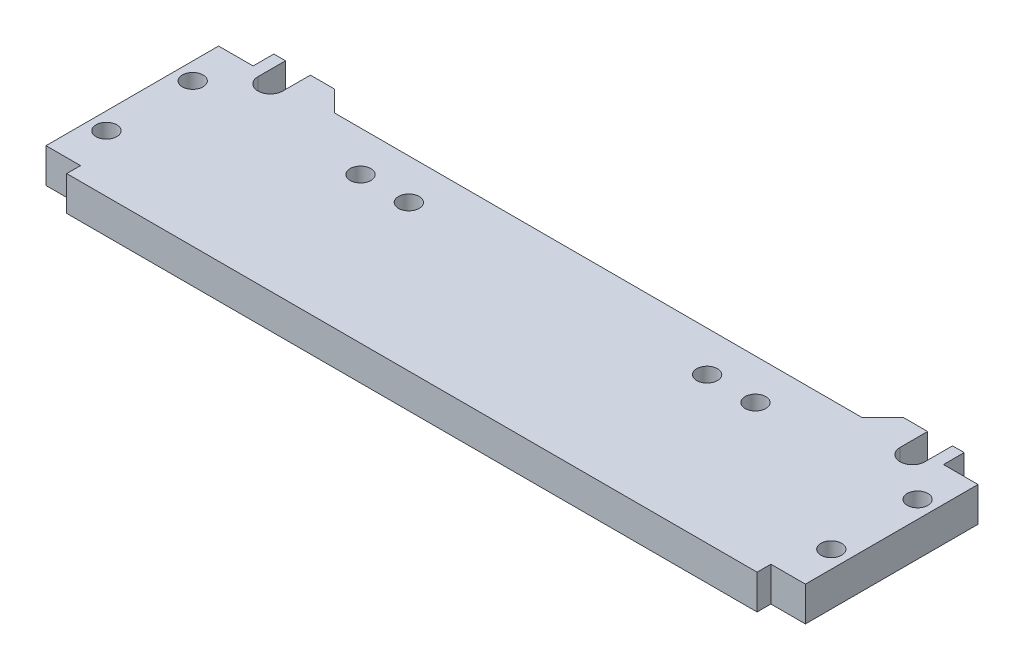
ISO-10303-21;
HEADER;
FILE_DESCRIPTION(('STEP AP214'),'2;1');
FILE_NAME('part.step','',(''),(''),'','','');
FILE_SCHEMA(('AUTOMOTIVE_DESIGN { 1 0 10303 214 1 1 1 1 }'));
ENDSEC;
DATA;
#1=APPLICATION_CONTEXT('core data for automotive mechanical design processes');
#2=APPLICATION_PROTOCOL_DEFINITION('international standard','automotive_design',2000,#1);
#3=PRODUCT_CONTEXT('',#1,'mechanical');
#4=PRODUCT('Part','Part','',(#3));
#5=PRODUCT_RELATED_PRODUCT_CATEGORY('part','',(#4));
#6=PRODUCT_DEFINITION_FORMATION('','',#4);
#7=PRODUCT_DEFINITION_CONTEXT('part definition',#1,'design');
#8=PRODUCT_DEFINITION('design','',#6,#7);
#9=PRODUCT_DEFINITION_SHAPE('','',#8);
#10=(LENGTH_UNIT() NAMED_UNIT(*) SI_UNIT(.MILLI.,.METRE.));
#11=(NAMED_UNIT(*) PLANE_ANGLE_UNIT() SI_UNIT($,.RADIAN.));
#12=(NAMED_UNIT(*) SI_UNIT($,.STERADIAN.) SOLID_ANGLE_UNIT());
#13=UNCERTAINTY_MEASURE_WITH_UNIT(LENGTH_MEASURE(1.E-05),#10,'distance_accuracy_value','');
#14=(GEOMETRIC_REPRESENTATION_CONTEXT(3) GLOBAL_UNCERTAINTY_ASSIGNED_CONTEXT((#13)) GLOBAL_UNIT_ASSIGNED_CONTEXT((#10,
#11,#12)) REPRESENTATION_CONTEXT('',''));
#15=CARTESIAN_POINT('',(0.,0.,0.));
#16=DIRECTION('',(0.,0.,1.));
#17=DIRECTION('',(1.,0.,0.));
#18=AXIS2_PLACEMENT_3D('',#15,#16,#17);
#19=CARTESIAN_POINT('',(110.,0.601965351764868,17.1368896841459));
#20=DIRECTION('',(0.,1.,0.));
#21=DIRECTION('',(0.,0.,1.));
#22=AXIS2_PLACEMENT_3D('',#19,#20,#21);
#23=PLANE('',#22);
#24=CARTESIAN_POINT('',(2.5,0.601965351764866,8.88688968414594));
#25=DIRECTION('',(0.,-1.,0.));
#26=DIRECTION('',(0.,0.,-1.));
#27=AXIS2_PLACEMENT_3D('',#24,#25,#26);
#28=CIRCLE('',#27,1.49999999999999);
#29=CARTESIAN_POINT('',(2.5,0.601965351764866,7.38688968414595));
#30=VERTEX_POINT('',#29);
#31=EDGE_CURVE('E799',#30,#30,#28,.T.);
#32=ORIENTED_EDGE('',*,*,#31,.F.);
#33=EDGE_LOOP('',(#32));
#34=FACE_BOUND('',#33,.T.);
#35=CARTESIAN_POINT('',(107.5,0.601965351764866,-3.61311031585405));
#36=DIRECTION('',(0.,-1.,0.));
#37=DIRECTION('',(0.,0.,-1.));
#38=AXIS2_PLACEMENT_3D('',#35,#36,#37);
#39=CIRCLE('',#38,1.49999999999999);
#40=CARTESIAN_POINT('',(107.5,0.601965351764866,-5.11311031585404));
#41=VERTEX_POINT('',#40);
#42=EDGE_CURVE('E490',#41,#41,#39,.T.);
#43=ORIENTED_EDGE('',*,*,#42,.F.);
#44=EDGE_LOOP('',(#43));
#45=FACE_BOUND('',#44,.T.);
#46=CARTESIAN_POINT('',(107.5,0.601965351764866,8.88688968414594));
#47=DIRECTION('',(0.,-1.,0.));
#48=DIRECTION('',(0.,0.,-1.));
#49=AXIS2_PLACEMENT_3D('',#46,#47,#48);
#50=CIRCLE('',#49,1.49999999999999);
#51=CARTESIAN_POINT('',(107.5,0.601965351764866,7.38688968414596));
#52=VERTEX_POINT('',#51);
#53=EDGE_CURVE('E481',#52,#52,#50,.T.);
#54=ORIENTED_EDGE('',*,*,#53,.F.);
#55=EDGE_LOOP('',(#54));
#56=FACE_BOUND('',#55,.T.);
#57=CARTESIAN_POINT('',(33.3970290493622,0.601965351764868,-4.02233273689054));
#58=DIRECTION('',(0.,1.,0.));
#59=DIRECTION('',(0.,0.,1.));
#60=AXIS2_PLACEMENT_3D('',#57,#58,#59);
#61=CIRCLE('',#60,1.5);
#62=CARTESIAN_POINT('',(33.3970290493622,0.601965351764868,-2.52233273689054));
#63=VERTEX_POINT('',#62);
#64=EDGE_CURVE('E389',#63,#63,#61,.T.);
#65=ORIENTED_EDGE('',*,*,#64,.T.);
#66=EDGE_LOOP('',(#65));
#67=FACE_BOUND('',#66,.T.);
#68=CARTESIAN_POINT('',(26.3970290493622,0.601965351764868,-4.02233273689054));
#69=DIRECTION('',(0.,1.,0.));
#70=DIRECTION('',(0.,0.,1.));
#71=AXIS2_PLACEMENT_3D('',#68,#69,#70);
#72=CIRCLE('',#71,1.5);
#73=CARTESIAN_POINT('',(26.3970290493622,0.601965351764868,-2.52233273689054));
#74=VERTEX_POINT('',#73);
#75=EDGE_CURVE('E383',#74,#74,#72,.T.);
#76=ORIENTED_EDGE('',*,*,#75,.T.);
#77=EDGE_LOOP('',(#76));
#78=FACE_BOUND('',#77,.T.);
#79=CARTESIAN_POINT('',(76.6029709506378,0.601965351764868,-4.02233273689054));
#80=DIRECTION('',(0.,1.,0.));
#81=DIRECTION('',(0.,0.,1.));
#82=AXIS2_PLACEMENT_3D('',#79,#80,#81);
#83=CIRCLE('',#82,1.5);
#84=CARTESIAN_POINT('',(76.6029709506378,0.601965351764868,-2.52233273689054));
#85=VERTEX_POINT('',#84);
#86=EDGE_CURVE('E377',#85,#85,#83,.T.);
#87=ORIENTED_EDGE('',*,*,#86,.T.);
#88=EDGE_LOOP('',(#87));
#89=FACE_BOUND('',#88,.T.);
#90=CARTESIAN_POINT('',(83.6029709506378,0.601965351764868,-4.02233273689054));
#91=DIRECTION('',(0.,1.,0.));
#92=DIRECTION('',(0.,0.,1.));
#93=AXIS2_PLACEMENT_3D('',#90,#91,#92);
#94=CIRCLE('',#93,1.5);
#95=CARTESIAN_POINT('',(83.6029709506378,0.601965351764868,-2.52233273689054));
#96=VERTEX_POINT('',#95);
#97=EDGE_CURVE('E371',#96,#96,#94,.T.);
#98=ORIENTED_EDGE('',*,*,#97,.T.);
#99=EDGE_LOOP('',(#98));
#100=FACE_BOUND('',#99,.T.);
#101=DIRECTION('',(1.,0.,0.));
#102=VECTOR('',#101,1.);
#103=CARTESIAN_POINT('',(10.3259524383656,0.601965351764868,-12.8631103158541));
#104=LINE('',#103,#102);
#105=CARTESIAN_POINT('',(10.294934667809,0.601965351764868,-12.8631103158541));
#106=VERTEX_POINT('',#105);
#107=CARTESIAN_POINT('',(13.7997678373939,0.601965351764868,-12.8631103158541));
#108=VERTEX_POINT('',#107);
#109=EDGE_CURVE('E209',#106,#108,#104,.T.);
#110=ORIENTED_EDGE('',*,*,#109,.T.);
#111=DIRECTION('',(-0.707106781186549,0.,-0.707106781186546));
#112=VECTOR('',#111,1.);
#113=CARTESIAN_POINT('',(16.7997678373939,0.601965351764868,-9.86311031585407));
#114=LINE('',#113,#112);
#115=CARTESIAN_POINT('',(16.7997678373939,0.601965351764868,-9.86311031585406));
#116=VERTEX_POINT('',#115);
#117=EDGE_CURVE('E11',#108,#116,#114,.F.);
#118=ORIENTED_EDGE('',*,*,#117,.T.);
#119=DIRECTION('',(-1.,0.,0.));
#120=VECTOR('',#119,1.);
#121=CARTESIAN_POINT('',(110.,0.601965351764868,-9.86311031585406));
#122=LINE('',#121,#120);
#123=CARTESIAN_POINT('',(93.2002321626061,0.601965351764868,-9.86311031585406));
#124=VERTEX_POINT('',#123);
#125=EDGE_CURVE('E324',#124,#116,#122,.T.);
#126=ORIENTED_EDGE('',*,*,#125,.F.);
#127=DIRECTION('',(-0.707106781186549,0.,0.707106781186546));
#128=VECTOR('',#127,1.);
#129=CARTESIAN_POINT('',(96.2002321626061,0.601965351764868,-12.8631103158541));
#130=LINE('',#129,#128);
#131=CARTESIAN_POINT('',(96.2002321626061,0.601965351764868,-12.8631103158541));
#132=VERTEX_POINT('',#131);
#133=EDGE_CURVE('E287',#124,#132,#130,.F.);
#134=ORIENTED_EDGE('',*,*,#133,.T.);
#135=DIRECTION('',(-1.,0.,0.));
#136=VECTOR('',#135,1.);
#137=CARTESIAN_POINT('',(105.,0.601965351764868,-12.8631103158541));
#138=LINE('',#137,#136);
#139=CARTESIAN_POINT('',(99.705065332191,0.601965351764868,-12.8631103158541));
#140=VERTEX_POINT('',#139);
#141=EDGE_CURVE('E259',#140,#132,#138,.T.);
#142=ORIENTED_EDGE('',*,*,#141,.F.);
#143=DIRECTION('',(0.,0.,1.));
#144=VECTOR('',#143,1.);
#145=CARTESIAN_POINT('',(99.705065332191,0.601965351764868,17.1368896841459));
#146=LINE('',#145,#144);
#147=CARTESIAN_POINT('',(99.705065332191,0.601965351764868,-8.86311031585405));
#148=VERTEX_POINT('',#147);
#149=EDGE_CURVE('E246',#140,#148,#146,.T.);
#150=ORIENTED_EDGE('',*,*,#149,.T.);
#151=CARTESIAN_POINT('',(101.505065332191,0.601965351764868,-8.86311031585406));
#152=DIRECTION('',(0.,1.,0.));
#153=DIRECTION('',(0.,0.,1.));
#154=AXIS2_PLACEMENT_3D('',#151,#152,#153);
#155=CIRCLE('',#154,1.8);
#156=CARTESIAN_POINT('',(103.305065332191,0.601965351764868,-8.86311031585405));
#157=VERTEX_POINT('',#156);
#158=EDGE_CURVE('E252',#157,#148,#155,.F.);
#159=ORIENTED_EDGE('',*,*,#158,.F.);
#160=DIRECTION('',(0.,0.,-1.));
#161=VECTOR('',#160,1.);
#162=CARTESIAN_POINT('',(103.305065332191,0.601965351764868,17.1368896841459));
#163=LINE('',#162,#161);
#164=CARTESIAN_POINT('',(103.305065332191,0.601965351764868,-12.8631103158541));
#165=VERTEX_POINT('',#164);
#166=EDGE_CURVE('E249',#157,#165,#163,.T.);
#167=ORIENTED_EDGE('',*,*,#166,.T.);
#168=CARTESIAN_POINT('',(105.,0.601965351764868,-12.8631103158541));
#169=VERTEX_POINT('',#168);
#170=EDGE_CURVE('E255',#169,#165,#138,.T.);
#171=ORIENTED_EDGE('',*,*,#170,.F.);
#172=DIRECTION('',(0.,0.,-1.));
#173=VECTOR('',#172,1.);
#174=CARTESIAN_POINT('',(105.,0.601965351764868,-9.86311031585406));
#175=LINE('',#174,#173);
#176=CARTESIAN_POINT('',(105.,0.601965351764868,-9.86311031585406));
#177=VERTEX_POINT('',#176);
#178=EDGE_CURVE('E263',#177,#169,#175,.T.);
#179=ORIENTED_EDGE('',*,*,#178,.F.);
#180=CARTESIAN_POINT('',(110.,0.601965351764868,-9.86311031585406));
#181=VERTEX_POINT('',#180);
#182=EDGE_CURVE('E317',#181,#177,#122,.T.);
#183=ORIENTED_EDGE('',*,*,#182,.F.);
#184=DIRECTION('',(0.,0.,-1.));
#185=VECTOR('',#184,1.);
#186=CARTESIAN_POINT('',(110.,0.601965351764868,17.1368896841459));
#187=LINE('',#186,#185);
#188=CARTESIAN_POINT('',(110.,0.601965351764868,15.1368896841459));
#189=VERTEX_POINT('',#188);
#190=EDGE_CURVE('E393',#189,#181,#187,.T.);
#191=ORIENTED_EDGE('',*,*,#190,.F.);
#192=DIRECTION('',(-1.,0.,0.));
#193=VECTOR('',#192,1.);
#194=CARTESIAN_POINT('',(110.,0.601965351764868,15.1368896841459));
#195=LINE('',#194,#193);
#196=CARTESIAN_POINT('',(105.,0.601965351764868,15.1368896841459));
#197=VERTEX_POINT('',#196);
#198=EDGE_CURVE('E347',#189,#197,#195,.T.);
#199=ORIENTED_EDGE('',*,*,#198,.T.);
#200=DIRECTION('',(0.,0.,-1.));
#201=VECTOR('',#200,1.);
#202=CARTESIAN_POINT('',(105.,0.601965351764868,17.1368896841459));
#203=LINE('',#202,#201);
#204=CARTESIAN_POINT('',(105.,0.601965351764868,17.1368896841459));
#205=VERTEX_POINT('',#204);
#206=EDGE_CURVE('E351',#205,#197,#203,.T.);
#207=ORIENTED_EDGE('',*,*,#206,.F.);
#208=DIRECTION('',(-1.,0.,0.));
#209=VECTOR('',#208,1.);
#210=CARTESIAN_POINT('',(110.,0.601965351764868,17.1368896841459));
#211=LINE('',#210,#209);
#212=CARTESIAN_POINT('',(5.,0.601965351764868,17.1368896841459));
#213=VERTEX_POINT('',#212);
#214=EDGE_CURVE('E316',#205,#213,#211,.T.);
#215=ORIENTED_EDGE('',*,*,#214,.T.);
#216=DIRECTION('',(0.,0.,-1.));
#217=VECTOR('',#216,1.);
#218=CARTESIAN_POINT('',(5.,0.601965351764868,17.1368896841459));
#219=LINE('',#218,#217);
#220=CARTESIAN_POINT('',(5.,0.601965351764868,15.1368896841459));
#221=VERTEX_POINT('',#220);
#222=EDGE_CURVE('E366',#213,#221,#219,.T.);
#223=ORIENTED_EDGE('',*,*,#222,.T.);
#224=DIRECTION('',(1.,0.,0.));
#225=VECTOR('',#224,1.);
#226=CARTESIAN_POINT('',(110.,0.601965351764868,15.1368896841459));
#227=LINE('',#226,#225);
#228=CARTESIAN_POINT('',(0.,0.601965351764868,15.1368896841459));
#229=VERTEX_POINT('',#228);
#230=EDGE_CURVE('E362',#229,#221,#227,.T.);
#231=ORIENTED_EDGE('',*,*,#230,.F.);
#232=DIRECTION('',(0.,0.,-1.));
#233=VECTOR('',#232,1.);
#234=CARTESIAN_POINT('',(0.,0.601965351764868,17.1368896841459));
#235=LINE('',#234,#233);
#236=CARTESIAN_POINT('',(0.,0.601965351764868,-9.86311031585406));
#237=VERTEX_POINT('',#236);
#238=EDGE_CURVE('E392',#229,#237,#235,.T.);
#239=ORIENTED_EDGE('',*,*,#238,.T.);
#240=CARTESIAN_POINT('',(5.,0.601965351764868,-9.86311031585406));
#241=VERTEX_POINT('',#240);
#242=EDGE_CURVE('E298',#241,#237,#122,.T.);
#243=ORIENTED_EDGE('',*,*,#242,.F.);
#244=DIRECTION('',(0.,0.,-1.));
#245=VECTOR('',#244,1.);
#246=CARTESIAN_POINT('',(5.,0.601965351764868,-9.86311031585406));
#247=LINE('',#246,#245);
#248=CARTESIAN_POINT('',(5.,0.601965351764868,-12.8631103158541));
#249=VERTEX_POINT('',#248);
#250=EDGE_CURVE('E223',#241,#249,#247,.T.);
#251=ORIENTED_EDGE('',*,*,#250,.T.);
#252=CARTESIAN_POINT('',(6.694934667809,0.601965351764868,-12.8631103158541));
#253=VERTEX_POINT('',#252);
#254=EDGE_CURVE('E503',#249,#253,#104,.T.);
#255=ORIENTED_EDGE('',*,*,#254,.T.);
#256=DIRECTION('',(0.,0.,-1.));
#257=VECTOR('',#256,1.);
#258=CARTESIAN_POINT('',(6.694934667809,0.601965351764868,17.1368896841459));
#259=LINE('',#258,#257);
#260=CARTESIAN_POINT('',(6.694934667809,0.601965351764868,-8.86311031585405));
#261=VERTEX_POINT('',#260);
#262=EDGE_CURVE('E501',#261,#253,#259,.T.);
#263=ORIENTED_EDGE('',*,*,#262,.F.);
#264=CARTESIAN_POINT('',(8.494934667809,0.601965351764868,-8.86311031585406));
#265=DIRECTION('',(0.,1.,0.));
#266=DIRECTION('',(0.,0.,1.));
#267=AXIS2_PLACEMENT_3D('',#264,#265,#266);
#268=CIRCLE('',#267,1.8);
#269=CARTESIAN_POINT('',(10.294934667809,0.601965351764868,-8.86311031585405));
#270=VERTEX_POINT('',#269);
#271=EDGE_CURVE('E214',#261,#270,#268,.T.);
#272=ORIENTED_EDGE('',*,*,#271,.T.);
#273=DIRECTION('',(0.,0.,1.));
#274=VECTOR('',#273,1.);
#275=CARTESIAN_POINT('',(10.294934667809,0.601965351764868,17.1368896841459));
#276=LINE('',#275,#274);
#277=EDGE_CURVE('E219',#106,#270,#276,.T.);
#278=ORIENTED_EDGE('',*,*,#277,.F.);
#279=EDGE_LOOP('',(#110,#118,#126,#134,#142,#150,#159,#167,#171,#179,#183,#191,#199,#207,#215,
#223,#231,#239,#243,#251,#255,#263,#272,#278));
#280=FACE_BOUND('',#279,.T.);
#281=CARTESIAN_POINT('',(2.5,0.601965351764866,-3.61311031585405));
#282=DIRECTION('',(0.,-1.,0.));
#283=DIRECTION('',(0.,0.,-1.));
#284=AXIS2_PLACEMENT_3D('',#281,#282,#283);
#285=CIRCLE('',#284,1.49999999999999);
#286=CARTESIAN_POINT('',(2.5,0.601965351764866,-5.11311031585404));
#287=VERTEX_POINT('',#286);
#288=EDGE_CURVE('E795',#287,#287,#285,.T.);
#289=ORIENTED_EDGE('',*,*,#288,.F.);
#290=EDGE_LOOP('',(#289));
#291=FACE_BOUND('',#290,.T.);
#292=ADVANCED_FACE('F33',(#34,#45,#56,#67,#78,#89,#100,#280,#291),#23,.F.);
#293=CARTESIAN_POINT('',(110.,5.60196535176487,17.1368896841459));
#294=DIRECTION('',(0.,-1.,0.));
#295=DIRECTION('',(0.,0.,-1.));
#296=AXIS2_PLACEMENT_3D('',#293,#294,#295);
#297=PLANE('',#296);
#298=CARTESIAN_POINT('',(2.5,5.60196535176487,-3.61311031585405));
#299=DIRECTION('',(0.,-1.,0.));
#300=DIRECTION('',(0.,0.,-1.));
#301=AXIS2_PLACEMENT_3D('',#298,#299,#300);
#302=CIRCLE('',#301,1.49999999999999);
#303=CARTESIAN_POINT('',(2.5,5.60196535176487,-5.11311031585404));
#304=VERTEX_POINT('',#303);
#305=EDGE_CURVE('E798',#304,#304,#302,.T.);
#306=ORIENTED_EDGE('',*,*,#305,.T.);
#307=EDGE_LOOP('',(#306));
#308=FACE_BOUND('',#307,.T.);
#309=CARTESIAN_POINT('',(2.5,5.60196535176487,8.88688968414594));
#310=DIRECTION('',(0.,-1.,0.));
#311=DIRECTION('',(0.,0.,-1.));
#312=AXIS2_PLACEMENT_3D('',#309,#310,#311);
#313=CIRCLE('',#312,1.49999999999999);
#314=CARTESIAN_POINT('',(2.5,5.60196535176487,7.38688968414596));
#315=VERTEX_POINT('',#314);
#316=EDGE_CURVE('E37',#315,#315,#313,.T.);
#317=ORIENTED_EDGE('',*,*,#316,.T.);
#318=EDGE_LOOP('',(#317));
#319=FACE_BOUND('',#318,.T.);
#320=CARTESIAN_POINT('',(107.5,5.60196535176487,-3.61311031585405));
#321=DIRECTION('',(0.,-1.,0.));
#322=DIRECTION('',(0.,0.,-1.));
#323=AXIS2_PLACEMENT_3D('',#320,#321,#322);
#324=CIRCLE('',#323,1.49999999999999);
#325=CARTESIAN_POINT('',(107.5,5.60196535176487,-5.11311031585404));
#326=VERTEX_POINT('',#325);
#327=EDGE_CURVE('E485',#326,#326,#324,.T.);
#328=ORIENTED_EDGE('',*,*,#327,.T.);
#329=EDGE_LOOP('',(#328));
#330=FACE_BOUND('',#329,.T.);
#331=CARTESIAN_POINT('',(107.5,5.60196535176487,8.88688968414594));
#332=DIRECTION('',(0.,-1.,0.));
#333=DIRECTION('',(0.,0.,-1.));
#334=AXIS2_PLACEMENT_3D('',#331,#332,#333);
#335=CIRCLE('',#334,1.49999999999999);
#336=CARTESIAN_POINT('',(107.5,5.60196535176487,7.38688968414596));
#337=VERTEX_POINT('',#336);
#338=EDGE_CURVE('E205',#337,#337,#335,.T.);
#339=ORIENTED_EDGE('',*,*,#338,.T.);
#340=EDGE_LOOP('',(#339));
#341=FACE_BOUND('',#340,.T.);
#342=CARTESIAN_POINT('',(33.3970290493622,5.60196535176487,-4.02233273689054));
#343=DIRECTION('',(0.,1.,0.));
#344=DIRECTION('',(0.,0.,1.));
#345=AXIS2_PLACEMENT_3D('',#342,#343,#344);
#346=CIRCLE('',#345,1.5);
#347=CARTESIAN_POINT('',(33.3970290493622,5.60196535176487,-2.52233273689054));
#348=VERTEX_POINT('',#347);
#349=EDGE_CURVE('E386',#348,#348,#346,.T.);
#350=ORIENTED_EDGE('',*,*,#349,.F.);
#351=EDGE_LOOP('',(#350));
#352=FACE_BOUND('',#351,.T.);
#353=CARTESIAN_POINT('',(26.3970290493622,5.60196535176487,-4.02233273689054));
#354=DIRECTION('',(0.,1.,0.));
#355=DIRECTION('',(0.,0.,1.));
#356=AXIS2_PLACEMENT_3D('',#353,#354,#355);
#357=CIRCLE('',#356,1.5);
#358=CARTESIAN_POINT('',(26.3970290493622,5.60196535176487,-2.52233273689054));
#359=VERTEX_POINT('',#358);
#360=EDGE_CURVE('E380',#359,#359,#357,.T.);
#361=ORIENTED_EDGE('',*,*,#360,.F.);
#362=EDGE_LOOP('',(#361));
#363=FACE_BOUND('',#362,.T.);
#364=CARTESIAN_POINT('',(76.6029709506378,5.60196535176487,-4.02233273689054));
#365=DIRECTION('',(0.,1.,0.));
#366=DIRECTION('',(0.,0.,1.));
#367=AXIS2_PLACEMENT_3D('',#364,#365,#366);
#368=CIRCLE('',#367,1.5);
#369=CARTESIAN_POINT('',(76.6029709506378,5.60196535176487,-2.52233273689054));
#370=VERTEX_POINT('',#369);
#371=EDGE_CURVE('E374',#370,#370,#368,.T.);
#372=ORIENTED_EDGE('',*,*,#371,.F.);
#373=EDGE_LOOP('',(#372));
#374=FACE_BOUND('',#373,.T.);
#375=CARTESIAN_POINT('',(83.6029709506378,5.60196535176487,-4.02233273689054));
#376=DIRECTION('',(0.,1.,0.));
#377=DIRECTION('',(0.,0.,1.));
#378=AXIS2_PLACEMENT_3D('',#375,#376,#377);
#379=CIRCLE('',#378,1.5);
#380=CARTESIAN_POINT('',(83.6029709506378,5.60196535176487,-2.52233273689054));
#381=VERTEX_POINT('',#380);
#382=EDGE_CURVE('E368',#381,#381,#379,.T.);
#383=ORIENTED_EDGE('',*,*,#382,.F.);
#384=EDGE_LOOP('',(#383));
#385=FACE_BOUND('',#384,.T.);
#386=DIRECTION('',(-1.,0.,0.));
#387=VECTOR('',#386,1.);
#388=CARTESIAN_POINT('',(110.,5.60196535176487,-9.86311031585406));
#389=LINE('',#388,#387);
#390=CARTESIAN_POINT('',(93.2002321626061,5.60196535176487,-9.86311031585406));
#391=VERTEX_POINT('',#390);
#392=CARTESIAN_POINT('',(16.7997678373939,5.60196535176487,-9.86311031585406));
#393=VERTEX_POINT('',#392);
#394=EDGE_CURVE('E296',#391,#393,#389,.T.);
#395=ORIENTED_EDGE('',*,*,#394,.T.);
#396=DIRECTION('',(0.707106781186549,0.,0.707106781186546));
#397=VECTOR('',#396,1.);
#398=CARTESIAN_POINT('',(16.7997678373939,5.60196535176487,-9.86311031585407));
#399=LINE('',#398,#397);
#400=CARTESIAN_POINT('',(13.7997678373939,5.60196535176487,-12.8631103158541));
#401=VERTEX_POINT('',#400);
#402=EDGE_CURVE('E57',#393,#401,#399,.F.);
#403=ORIENTED_EDGE('',*,*,#402,.T.);
#404=DIRECTION('',(1.,0.,0.));
#405=VECTOR('',#404,1.);
#406=CARTESIAN_POINT('',(5.,5.60196535176487,-12.8631103158541));
#407=LINE('',#406,#405);
#408=CARTESIAN_POINT('',(10.294934667809,5.60196535176487,-12.8631103158541));
#409=VERTEX_POINT('',#408);
#410=EDGE_CURVE('E208',#409,#401,#407,.T.);
#411=ORIENTED_EDGE('',*,*,#410,.F.);
#412=DIRECTION('',(0.,0.,1.));
#413=VECTOR('',#412,1.);
#414=CARTESIAN_POINT('',(10.294934667809,5.60196535176487,-12.8631103158541));
#415=LINE('',#414,#413);
#416=CARTESIAN_POINT('',(10.294934667809,5.60196535176487,-8.86311031585405));
#417=VERTEX_POINT('',#416);
#418=EDGE_CURVE('E195',#409,#417,#415,.T.);
#419=ORIENTED_EDGE('',*,*,#418,.T.);
#420=CARTESIAN_POINT('',(8.494934667809,5.60196535176487,-8.86311031585406));
#421=DIRECTION('',(0.,1.,0.));
#422=DIRECTION('',(0.,0.,-1.));
#423=AXIS2_PLACEMENT_3D('',#420,#421,#422);
#424=CIRCLE('',#423,1.8);
#425=CARTESIAN_POINT('',(6.694934667809,5.60196535176487,-8.86311031585405));
#426=VERTEX_POINT('',#425);
#427=EDGE_CURVE('E204',#426,#417,#424,.T.);
#428=ORIENTED_EDGE('',*,*,#427,.F.);
#429=DIRECTION('',(0.,0.,-1.));
#430=VECTOR('',#429,1.);
#431=CARTESIAN_POINT('',(6.694934667809,5.60196535176487,-8.86311031585405));
#432=LINE('',#431,#430);
#433=CARTESIAN_POINT('',(6.694934667809,5.60196535176487,-12.8631103158541));
#434=VERTEX_POINT('',#433);
#435=EDGE_CURVE('E495',#426,#434,#432,.T.);
#436=ORIENTED_EDGE('',*,*,#435,.T.);
#437=CARTESIAN_POINT('',(5.,5.60196535176487,-12.8631103158541));
#438=VERTEX_POINT('',#437);
#439=EDGE_CURVE('E213',#438,#434,#407,.T.);
#440=ORIENTED_EDGE('',*,*,#439,.F.);
#441=DIRECTION('',(0.,0.,-1.));
#442=VECTOR('',#441,1.);
#443=CARTESIAN_POINT('',(5.,5.60196535176487,-9.86311031585406));
#444=LINE('',#443,#442);
#445=CARTESIAN_POINT('',(5.,5.60196535176487,-9.86311031585406));
#446=VERTEX_POINT('',#445);
#447=EDGE_CURVE('E217',#446,#438,#444,.T.);
#448=ORIENTED_EDGE('',*,*,#447,.F.);
#449=CARTESIAN_POINT('',(0.,5.60196535176487,-9.86311031585406));
#450=VERTEX_POINT('',#449);
#451=EDGE_CURVE('E293',#446,#450,#389,.T.);
#452=ORIENTED_EDGE('',*,*,#451,.T.);
#453=DIRECTION('',(0.,0.,1.));
#454=VECTOR('',#453,1.);
#455=CARTESIAN_POINT('',(0.,5.60196535176487,17.1368896841459));
#456=LINE('',#455,#454);
#457=CARTESIAN_POINT('',(0.,5.60196535176487,15.1368896841459));
#458=VERTEX_POINT('',#457);
#459=EDGE_CURVE('E396',#450,#458,#456,.T.);
#460=ORIENTED_EDGE('',*,*,#459,.T.);
#461=DIRECTION('',(1.,0.,0.));
#462=VECTOR('',#461,1.);
#463=CARTESIAN_POINT('',(0.,5.60196535176487,15.1368896841459));
#464=LINE('',#463,#462);
#465=CARTESIAN_POINT('',(5.,5.60196535176487,15.1368896841459));
#466=VERTEX_POINT('',#465);
#467=EDGE_CURVE('E356',#458,#466,#464,.T.);
#468=ORIENTED_EDGE('',*,*,#467,.T.);
#469=DIRECTION('',(0.,0.,-1.));
#470=VECTOR('',#469,1.);
#471=CARTESIAN_POINT('',(5.,5.60196535176487,17.1368896841459));
#472=LINE('',#471,#470);
#473=CARTESIAN_POINT('',(5.,5.60196535176487,17.1368896841459));
#474=VERTEX_POINT('',#473);
#475=EDGE_CURVE('E353',#474,#466,#472,.T.);
#476=ORIENTED_EDGE('',*,*,#475,.F.);
#477=DIRECTION('',(-1.,0.,0.));
#478=VECTOR('',#477,1.);
#479=CARTESIAN_POINT('',(110.,5.60196535176487,17.1368896841459));
#480=LINE('',#479,#478);
#481=CARTESIAN_POINT('',(105.,5.60196535176487,17.1368896841459));
#482=VERTEX_POINT('',#481);
#483=EDGE_CURVE('E297',#482,#474,#480,.T.);
#484=ORIENTED_EDGE('',*,*,#483,.F.);
#485=DIRECTION('',(0.,0.,-1.));
#486=VECTOR('',#485,1.);
#487=CARTESIAN_POINT('',(105.,5.60196535176487,17.1368896841459));
#488=LINE('',#487,#486);
#489=CARTESIAN_POINT('',(105.,5.60196535176487,15.1368896841459));
#490=VERTEX_POINT('',#489);
#491=EDGE_CURVE('E340',#482,#490,#488,.T.);
#492=ORIENTED_EDGE('',*,*,#491,.T.);
#493=DIRECTION('',(-1.,0.,0.));
#494=VECTOR('',#493,1.);
#495=CARTESIAN_POINT('',(110.,5.60196535176487,15.1368896841459));
#496=LINE('',#495,#494);
#497=CARTESIAN_POINT('',(110.,5.60196535176487,15.1368896841459));
#498=VERTEX_POINT('',#497);
#499=EDGE_CURVE('E274',#498,#490,#496,.T.);
#500=ORIENTED_EDGE('',*,*,#499,.F.);
#501=DIRECTION('',(0.,0.,1.));
#502=VECTOR('',#501,1.);
#503=CARTESIAN_POINT('',(110.,5.60196535176487,17.1368896841459));
#504=LINE('',#503,#502);
#505=CARTESIAN_POINT('',(110.,5.60196535176487,-9.86311031585406));
#506=VERTEX_POINT('',#505);
#507=EDGE_CURVE('E398',#506,#498,#504,.T.);
#508=ORIENTED_EDGE('',*,*,#507,.F.);
#509=CARTESIAN_POINT('',(105.,5.60196535176487,-9.86311031585406));
#510=VERTEX_POINT('',#509);
#511=EDGE_CURVE('E311',#506,#510,#389,.T.);
#512=ORIENTED_EDGE('',*,*,#511,.T.);
#513=DIRECTION('',(0.,0.,-1.));
#514=VECTOR('',#513,1.);
#515=CARTESIAN_POINT('',(105.,5.60196535176487,-9.86311031585406));
#516=LINE('',#515,#514);
#517=CARTESIAN_POINT('',(105.,5.60196535176487,-12.8631103158541));
#518=VERTEX_POINT('',#517);
#519=EDGE_CURVE('E254',#510,#518,#516,.T.);
#520=ORIENTED_EDGE('',*,*,#519,.T.);
#521=DIRECTION('',(-1.,0.,0.));
#522=VECTOR('',#521,1.);
#523=CARTESIAN_POINT('',(99.6740475616344,5.60196535176487,-12.8631103158541));
#524=LINE('',#523,#522);
#525=CARTESIAN_POINT('',(103.305065332191,5.60196535176487,-12.8631103158541));
#526=VERTEX_POINT('',#525);
#527=EDGE_CURVE('E260',#518,#526,#524,.T.);
#528=ORIENTED_EDGE('',*,*,#527,.T.);
#529=DIRECTION('',(0.,0.,-1.));
#530=VECTOR('',#529,1.);
#531=CARTESIAN_POINT('',(103.305065332191,5.60196535176487,-8.86311031585405));
#532=LINE('',#531,#530);
#533=CARTESIAN_POINT('',(103.305065332191,5.60196535176487,-8.86311031585405));
#534=VERTEX_POINT('',#533);
#535=EDGE_CURVE('E228',#534,#526,#532,.T.);
#536=ORIENTED_EDGE('',*,*,#535,.F.);
#537=CARTESIAN_POINT('',(101.505065332191,5.60196535176487,-8.86311031585406));
#538=DIRECTION('',(0.,-1.,0.));
#539=DIRECTION('',(0.,0.,-1.));
#540=AXIS2_PLACEMENT_3D('',#537,#538,#539);
#541=CIRCLE('',#540,1.8);
#542=CARTESIAN_POINT('',(99.705065332191,5.60196535176487,-8.86311031585405));
#543=VERTEX_POINT('',#542);
#544=EDGE_CURVE('E236',#534,#543,#541,.T.);
#545=ORIENTED_EDGE('',*,*,#544,.T.);
#546=DIRECTION('',(0.,0.,1.));
#547=VECTOR('',#546,1.);
#548=CARTESIAN_POINT('',(99.705065332191,5.60196535176487,-12.8631103158541));
#549=LINE('',#548,#547);
#550=CARTESIAN_POINT('',(99.705065332191,5.60196535176487,-12.8631103158541));
#551=VERTEX_POINT('',#550);
#552=EDGE_CURVE('E239',#551,#543,#549,.T.);
#553=ORIENTED_EDGE('',*,*,#552,.F.);
#554=CARTESIAN_POINT('',(96.2002321626061,5.60196535176487,-12.8631103158541));
#555=VERTEX_POINT('',#554);
#556=EDGE_CURVE('E264',#551,#555,#524,.T.);
#557=ORIENTED_EDGE('',*,*,#556,.T.);
#558=DIRECTION('',(0.707106781186549,0.,-0.707106781186546));
#559=VECTOR('',#558,1.);
#560=CARTESIAN_POINT('',(96.2002321626061,5.60196535176487,-12.8631103158541));
#561=LINE('',#560,#559);
#562=EDGE_CURVE('E285',#555,#391,#561,.F.);
#563=ORIENTED_EDGE('',*,*,#562,.T.);
#564=EDGE_LOOP('',(#395,#403,#411,#419,#428,#436,#440,#448,#452,#460,#468,#476,#484,#492,#500,
#508,#512,#520,#528,#536,#545,#553,#557,#563));
#565=FACE_BOUND('',#564,.T.);
#566=ADVANCED_FACE('F212',(#308,#319,#330,#341,#352,#363,#374,#385,#565),#297,.F.);
#567=CARTESIAN_POINT('',(5.,0.601965351764868,-12.8631103158541));
#568=DIRECTION('',(0.,0.,1.));
#569=DIRECTION('',(1.,0.,0.));
#570=AXIS2_PLACEMENT_3D('',#567,#568,#569);
#571=PLANE('',#570);
#572=ORIENTED_EDGE('',*,*,#410,.T.);
#573=DIRECTION('',(0.,-1.,0.));
#574=VECTOR('',#573,1.);
#575=CARTESIAN_POINT('',(13.7997678373939,0.601965351764868,-12.8631103158541));
#576=LINE('',#575,#574);
#577=EDGE_CURVE('E42',#401,#108,#576,.T.);
#578=ORIENTED_EDGE('',*,*,#577,.T.);
#579=ORIENTED_EDGE('',*,*,#109,.F.);
#580=DIRECTION('',(0.,-1.,0.));
#581=VECTOR('',#580,1.);
#582=CARTESIAN_POINT('',(10.294934667809,0.601965351764868,-12.8631103158541));
#583=LINE('',#582,#581);
#584=EDGE_CURVE('E198',#409,#106,#583,.T.);
#585=ORIENTED_EDGE('',*,*,#584,.F.);
#586=EDGE_LOOP('',(#572,#578,#579,#585));
#587=FACE_BOUND('',#586,.T.);
#588=ADVANCED_FACE('F207',(#587),#571,.F.);
#589=DIRECTION('',(0.,1.,0.));
#590=VECTOR('',#589,1.);
#591=CARTESIAN_POINT('',(6.694934667809,0.601965351764868,-12.8631103158541));
#592=LINE('',#591,#590);
#593=EDGE_CURVE('E210',#253,#434,#592,.T.);
#594=ORIENTED_EDGE('',*,*,#593,.F.);
#595=ORIENTED_EDGE('',*,*,#254,.F.);
#596=DIRECTION('',(0.,1.,0.));
#597=VECTOR('',#596,1.);
#598=CARTESIAN_POINT('',(5.,0.601965351764868,-12.8631103158541));
#599=LINE('',#598,#597);
#600=EDGE_CURVE('E229',#249,#438,#599,.T.);
#601=ORIENTED_EDGE('',*,*,#600,.T.);
#602=ORIENTED_EDGE('',*,*,#439,.T.);
#603=EDGE_LOOP('',(#594,#595,#601,#602));
#604=FACE_BOUND('',#603,.T.);
#605=ADVANCED_FACE('F515',(#604),#571,.F.);
#606=CARTESIAN_POINT('',(110.,5.60196535176487,-9.86311031585406));
#607=DIRECTION('',(0.,0.,1.));
#608=DIRECTION('',(0.,-1.,0.));
#609=AXIS2_PLACEMENT_3D('',#606,#607,#608);
#610=PLANE('',#609);
#611=DIRECTION('',(0.,1.,0.));
#612=VECTOR('',#611,1.);
#613=CARTESIAN_POINT('',(5.,0.601965351764868,-9.86311031585406));
#614=LINE('',#613,#612);
#615=EDGE_CURVE('E226',#241,#446,#614,.T.);
#616=ORIENTED_EDGE('',*,*,#615,.F.);
#617=ORIENTED_EDGE('',*,*,#242,.T.);
#618=DIRECTION('',(0.,1.,0.));
#619=VECTOR('',#618,1.);
#620=CARTESIAN_POINT('',(0.,5.60196535176487,-9.86311031585406));
#621=LINE('',#620,#619);
#622=EDGE_CURVE('E403',#237,#450,#621,.T.);
#623=ORIENTED_EDGE('',*,*,#622,.T.);
#624=ORIENTED_EDGE('',*,*,#451,.F.);
#625=EDGE_LOOP('',(#616,#617,#623,#624));
#626=FACE_BOUND('',#625,.T.);
#627=ADVANCED_FACE('F521',(#626),#610,.F.);
#628=DIRECTION('',(0.,1.,0.));
#629=VECTOR('',#628,1.);
#630=CARTESIAN_POINT('',(16.7997678373939,0.601965351764868,-9.86311031585406));
#631=LINE('',#630,#629);
#632=EDGE_CURVE('E232',#116,#393,#631,.T.);
#633=ORIENTED_EDGE('',*,*,#632,.T.);
#634=ORIENTED_EDGE('',*,*,#394,.F.);
#635=DIRECTION('',(0.,1.,0.));
#636=VECTOR('',#635,1.);
#637=CARTESIAN_POINT('',(93.2002321626061,0.601965351764868,-9.86311031585406));
#638=LINE('',#637,#636);
#639=EDGE_CURVE('E270',#124,#391,#638,.T.);
#640=ORIENTED_EDGE('',*,*,#639,.F.);
#641=ORIENTED_EDGE('',*,*,#125,.T.);
#642=EDGE_LOOP('',(#633,#634,#640,#641));
#643=FACE_BOUND('',#642,.T.);
#644=ADVANCED_FACE('F473',(#643),#610,.F.);
#645=CARTESIAN_POINT('',(99.6740475616344,0.601965351764868,-12.8631103158541));
#646=DIRECTION('',(0.,0.,-1.));
#647=DIRECTION('',(-1.,0.,0.));
#648=AXIS2_PLACEMENT_3D('',#645,#646,#647);
#649=PLANE('',#648);
#650=DIRECTION('',(0.,-1.,0.));
#651=VECTOR('',#650,1.);
#652=CARTESIAN_POINT('',(103.305065332191,0.601965351764868,-12.8631103158541));
#653=LINE('',#652,#651);
#654=EDGE_CURVE('E279',#526,#165,#653,.T.);
#655=ORIENTED_EDGE('',*,*,#654,.F.);
#656=ORIENTED_EDGE('',*,*,#527,.F.);
#657=DIRECTION('',(0.,1.,0.));
#658=VECTOR('',#657,1.);
#659=CARTESIAN_POINT('',(105.,0.601965351764868,-12.8631103158541));
#660=LINE('',#659,#658);
#661=EDGE_CURVE('E267',#169,#518,#660,.T.);
#662=ORIENTED_EDGE('',*,*,#661,.F.);
#663=ORIENTED_EDGE('',*,*,#170,.T.);
#664=EDGE_LOOP('',(#655,#656,#662,#663));
#665=FACE_BOUND('',#664,.T.);
#666=ADVANCED_FACE('F449',(#665),#649,.T.);
#667=CARTESIAN_POINT('',(110.,5.60196535176487,17.1368896841459));
#668=DIRECTION('',(0.,0.,-1.));
#669=DIRECTION('',(-1.,0.,0.));
#670=AXIS2_PLACEMENT_3D('',#667,#668,#669);
#671=PLANE('',#670);
#672=DIRECTION('',(0.,1.,0.));
#673=VECTOR('',#672,1.);
#674=CARTESIAN_POINT('',(105.,-4.39803464823513,17.1368896841459));
#675=LINE('',#674,#673);
#676=EDGE_CURVE('E344',#205,#482,#675,.T.);
#677=ORIENTED_EDGE('',*,*,#676,.T.);
#678=ORIENTED_EDGE('',*,*,#483,.T.);
#679=DIRECTION('',(0.,1.,0.));
#680=VECTOR('',#679,1.);
#681=CARTESIAN_POINT('',(5.,-4.39803464823513,17.1368896841459));
#682=LINE('',#681,#680);
#683=EDGE_CURVE('E359',#213,#474,#682,.T.);
#684=ORIENTED_EDGE('',*,*,#683,.F.);
#685=ORIENTED_EDGE('',*,*,#214,.F.);
#686=EDGE_LOOP('',(#677,#678,#684,#685));
#687=FACE_BOUND('',#686,.T.);
#688=ADVANCED_FACE('F425',(#687),#671,.F.);
#689=CARTESIAN_POINT('',(0.,0.,0.));
#690=DIRECTION('',(1.,0.,0.));
#691=DIRECTION('',(0.,0.,-1.));
#692=AXIS2_PLACEMENT_3D('',#689,#690,#691);
#693=PLANE('',#692);
#694=DIRECTION('',(0.,-1.,0.));
#695=VECTOR('',#694,1.);
#696=CARTESIAN_POINT('',(0.,0.,15.1368896841459));
#697=LINE('',#696,#695);
#698=EDGE_CURVE('E315',#458,#229,#697,.T.);
#699=ORIENTED_EDGE('',*,*,#698,.F.);
#700=ORIENTED_EDGE('',*,*,#459,.F.);
#701=ORIENTED_EDGE('',*,*,#622,.F.);
#702=ORIENTED_EDGE('',*,*,#238,.F.);
#703=EDGE_LOOP('',(#699,#700,#701,#702));
#704=FACE_BOUND('',#703,.T.);
#705=ADVANCED_FACE('F413',(#704),#693,.F.);
#706=ORIENTED_EDGE('',*,*,#182,.T.);
#707=DIRECTION('',(0.,1.,0.));
#708=VECTOR('',#707,1.);
#709=CARTESIAN_POINT('',(105.,0.601965351764868,-9.86311031585406));
#710=LINE('',#709,#708);
#711=EDGE_CURVE('E258',#177,#510,#710,.T.);
#712=ORIENTED_EDGE('',*,*,#711,.T.);
#713=ORIENTED_EDGE('',*,*,#511,.F.);
#714=DIRECTION('',(0.,1.,0.));
#715=VECTOR('',#714,1.);
#716=CARTESIAN_POINT('',(110.,5.60196535176487,-9.86311031585406));
#717=LINE('',#716,#715);
#718=EDGE_CURVE('E395',#181,#506,#717,.T.);
#719=ORIENTED_EDGE('',*,*,#718,.F.);
#720=EDGE_LOOP('',(#706,#712,#713,#719));
#721=FACE_BOUND('',#720,.T.);
#722=ADVANCED_FACE('F442',(#721),#610,.F.);
#723=CARTESIAN_POINT('',(110.,0.,0.));
#724=DIRECTION('',(1.,0.,0.));
#725=DIRECTION('',(0.,0.,-1.));
#726=AXIS2_PLACEMENT_3D('',#723,#724,#725);
#727=PLANE('',#726);
#728=DIRECTION('',(0.,1.,0.));
#729=VECTOR('',#728,1.);
#730=CARTESIAN_POINT('',(110.,0.,15.1368896841459));
#731=LINE('',#730,#729);
#732=EDGE_CURVE('E280',#189,#498,#731,.T.);
#733=ORIENTED_EDGE('',*,*,#732,.F.);
#734=ORIENTED_EDGE('',*,*,#190,.T.);
#735=ORIENTED_EDGE('',*,*,#718,.T.);
#736=ORIENTED_EDGE('',*,*,#507,.T.);
#737=EDGE_LOOP('',(#733,#734,#735,#736));
#738=FACE_BOUND('',#737,.T.);
#739=ADVANCED_FACE('F437',(#738),#727,.T.);
#740=CARTESIAN_POINT('',(33.3970290493622,5.60196535176487,-4.02233273689054));
#741=DIRECTION('',(0.,1.,0.));
#742=DIRECTION('',(0.,0.,1.));
#743=AXIS2_PLACEMENT_3D('',#740,#741,#742);
#744=CYLINDRICAL_SURFACE('',#743,1.5);
#745=ORIENTED_EDGE('',*,*,#349,.T.);
#746=EDGE_LOOP('',(#745));
#747=FACE_BOUND('',#746,.T.);
#748=ORIENTED_EDGE('',*,*,#64,.F.);
#749=EDGE_LOOP('',(#748));
#750=FACE_BOUND('',#749,.T.);
#751=ADVANCED_FACE('F580',(#747,#750),#744,.F.);
#752=CARTESIAN_POINT('',(26.3970290493622,5.60196535176487,-4.02233273689054));
#753=DIRECTION('',(0.,1.,0.));
#754=DIRECTION('',(0.,0.,1.));
#755=AXIS2_PLACEMENT_3D('',#752,#753,#754);
#756=CYLINDRICAL_SURFACE('',#755,1.5);
#757=ORIENTED_EDGE('',*,*,#360,.T.);
#758=EDGE_LOOP('',(#757));
#759=FACE_BOUND('',#758,.T.);
#760=ORIENTED_EDGE('',*,*,#75,.F.);
#761=EDGE_LOOP('',(#760));
#762=FACE_BOUND('',#761,.T.);
#763=ADVANCED_FACE('F576',(#759,#762),#756,.F.);
#764=CARTESIAN_POINT('',(76.6029709506378,5.60196535176487,-4.02233273689054));
#765=DIRECTION('',(0.,1.,0.));
#766=DIRECTION('',(0.,0.,1.));
#767=AXIS2_PLACEMENT_3D('',#764,#765,#766);
#768=CYLINDRICAL_SURFACE('',#767,1.5);
#769=ORIENTED_EDGE('',*,*,#371,.T.);
#770=EDGE_LOOP('',(#769));
#771=FACE_BOUND('',#770,.T.);
#772=ORIENTED_EDGE('',*,*,#86,.F.);
#773=EDGE_LOOP('',(#772));
#774=FACE_BOUND('',#773,.T.);
#775=ADVANCED_FACE('F572',(#771,#774),#768,.F.);
#776=CARTESIAN_POINT('',(83.6029709506378,5.60196535176487,-4.02233273689054));
#777=DIRECTION('',(0.,1.,0.));
#778=DIRECTION('',(0.,0.,1.));
#779=AXIS2_PLACEMENT_3D('',#776,#777,#778);
#780=CYLINDRICAL_SURFACE('',#779,1.5);
#781=ORIENTED_EDGE('',*,*,#382,.T.);
#782=EDGE_LOOP('',(#781));
#783=FACE_BOUND('',#782,.T.);
#784=ORIENTED_EDGE('',*,*,#97,.F.);
#785=EDGE_LOOP('',(#784));
#786=FACE_BOUND('',#785,.T.);
#787=ADVANCED_FACE('F569',(#783,#786),#780,.F.);
#788=CARTESIAN_POINT('',(5.,-4.39803464823513,17.1368896841459));
#789=DIRECTION('',(1.,0.,0.));
#790=DIRECTION('',(0.,0.,-1.));
#791=AXIS2_PLACEMENT_3D('',#788,#789,#790);
#792=PLANE('',#791);
#793=ORIENTED_EDGE('',*,*,#683,.T.);
#794=ORIENTED_EDGE('',*,*,#475,.T.);
#795=DIRECTION('',(0.,1.,0.));
#796=VECTOR('',#795,1.);
#797=CARTESIAN_POINT('',(5.,-4.39803464823513,15.1368896841459));
#798=LINE('',#797,#796);
#799=EDGE_CURVE('E360',#221,#466,#798,.T.);
#800=ORIENTED_EDGE('',*,*,#799,.F.);
#801=ORIENTED_EDGE('',*,*,#222,.F.);
#802=EDGE_LOOP('',(#793,#794,#800,#801));
#803=FACE_BOUND('',#802,.T.);
#804=ADVANCED_FACE('F423',(#803),#792,.F.);
#805=CARTESIAN_POINT('',(0.,-4.39803464823513,15.1368896841459));
#806=DIRECTION('',(0.,0.,1.));
#807=DIRECTION('',(1.,0.,0.));
#808=AXIS2_PLACEMENT_3D('',#805,#806,#807);
#809=PLANE('',#808);
#810=ORIENTED_EDGE('',*,*,#230,.T.);
#811=ORIENTED_EDGE('',*,*,#799,.T.);
#812=ORIENTED_EDGE('',*,*,#467,.F.);
#813=ORIENTED_EDGE('',*,*,#698,.T.);
#814=EDGE_LOOP('',(#810,#811,#812,#813));
#815=FACE_BOUND('',#814,.T.);
#816=ADVANCED_FACE('F417',(#815),#809,.T.);
#817=CARTESIAN_POINT('',(105.,-4.39803464823513,17.1368896841459));
#818=DIRECTION('',(1.,0.,0.));
#819=DIRECTION('',(0.,0.,-1.));
#820=AXIS2_PLACEMENT_3D('',#817,#818,#819);
#821=PLANE('',#820);
#822=ORIENTED_EDGE('',*,*,#206,.T.);
#823=DIRECTION('',(0.,1.,0.));
#824=VECTOR('',#823,1.);
#825=CARTESIAN_POINT('',(105.,-4.39803464823513,15.1368896841459));
#826=LINE('',#825,#824);
#827=EDGE_CURVE('E343',#197,#490,#826,.T.);
#828=ORIENTED_EDGE('',*,*,#827,.T.);
#829=ORIENTED_EDGE('',*,*,#491,.F.);
#830=ORIENTED_EDGE('',*,*,#676,.F.);
#831=EDGE_LOOP('',(#822,#828,#829,#830));
#832=FACE_BOUND('',#831,.T.);
#833=ADVANCED_FACE('F430',(#832),#821,.T.);
#834=CARTESIAN_POINT('',(110.,-4.39803464823513,15.1368896841459));
#835=DIRECTION('',(0.,0.,-1.));
#836=DIRECTION('',(-1.,0.,0.));
#837=AXIS2_PLACEMENT_3D('',#834,#835,#836);
#838=PLANE('',#837);
#839=ORIENTED_EDGE('',*,*,#732,.T.);
#840=ORIENTED_EDGE('',*,*,#499,.T.);
#841=ORIENTED_EDGE('',*,*,#827,.F.);
#842=ORIENTED_EDGE('',*,*,#198,.F.);
#843=EDGE_LOOP('',(#839,#840,#841,#842));
#844=FACE_BOUND('',#843,.T.);
#845=ADVANCED_FACE('F433',(#844),#838,.F.);
#846=ORIENTED_EDGE('',*,*,#141,.T.);
#847=DIRECTION('',(0.,1.,0.));
#848=VECTOR('',#847,1.);
#849=CARTESIAN_POINT('',(96.2002321626061,0.601965351764868,-12.8631103158541));
#850=LINE('',#849,#848);
#851=EDGE_CURVE('E282',#132,#555,#850,.T.);
#852=ORIENTED_EDGE('',*,*,#851,.T.);
#853=ORIENTED_EDGE('',*,*,#556,.F.);
#854=DIRECTION('',(0.,1.,0.));
#855=VECTOR('',#854,1.);
#856=CARTESIAN_POINT('',(99.705065332191,0.601965351764868,-12.8631103158541));
#857=LINE('',#856,#855);
#858=EDGE_CURVE('E277',#140,#551,#857,.T.);
#859=ORIENTED_EDGE('',*,*,#858,.F.);
#860=EDGE_LOOP('',(#846,#852,#853,#859));
#861=FACE_BOUND('',#860,.T.);
#862=ADVANCED_FACE('F465',(#861),#649,.T.);
#863=CARTESIAN_POINT('',(105.,0.601965351764868,-9.86311031585406));
#864=DIRECTION('',(1.,0.,0.));
#865=DIRECTION('',(0.,0.,-1.));
#866=AXIS2_PLACEMENT_3D('',#863,#864,#865);
#867=PLANE('',#866);
#868=ORIENTED_EDGE('',*,*,#519,.F.);
#869=ORIENTED_EDGE('',*,*,#711,.F.);
#870=ORIENTED_EDGE('',*,*,#178,.T.);
#871=ORIENTED_EDGE('',*,*,#661,.T.);
#872=EDGE_LOOP('',(#868,#869,#870,#871));
#873=FACE_BOUND('',#872,.T.);
#874=ADVANCED_FACE('F446',(#873),#867,.T.);
#875=CARTESIAN_POINT('',(101.505065332191,-4.39803464823513,-8.86311031585406));
#876=DIRECTION('',(0.,1.,0.));
#877=DIRECTION('',(0.,0.,1.));
#878=AXIS2_PLACEMENT_3D('',#875,#876,#877);
#879=CYLINDRICAL_SURFACE('',#878,1.8);
#880=ORIENTED_EDGE('',*,*,#158,.T.);
#881=DIRECTION('',(0.,1.,0.));
#882=VECTOR('',#881,1.);
#883=CARTESIAN_POINT('',(99.705065332191,-4.39803464823513,-8.86311031585405));
#884=LINE('',#883,#882);
#885=EDGE_CURVE('E242',#148,#543,#884,.T.);
#886=ORIENTED_EDGE('',*,*,#885,.T.);
#887=ORIENTED_EDGE('',*,*,#544,.F.);
#888=DIRECTION('',(0.,1.,0.));
#889=VECTOR('',#888,1.);
#890=CARTESIAN_POINT('',(103.305065332191,-4.39803464823513,-8.86311031585405));
#891=LINE('',#890,#889);
#892=EDGE_CURVE('E244',#157,#534,#891,.T.);
#893=ORIENTED_EDGE('',*,*,#892,.F.);
#894=EDGE_LOOP('',(#880,#886,#887,#893));
#895=FACE_BOUND('',#894,.T.);
#896=ADVANCED_FACE('F456',(#895),#879,.F.);
#897=CARTESIAN_POINT('',(103.305065332191,-4.39803464823513,-8.86311031585405));
#898=DIRECTION('',(1.,0.,0.));
#899=DIRECTION('',(0.,0.,-1.));
#900=AXIS2_PLACEMENT_3D('',#897,#898,#899);
#901=PLANE('',#900);
#902=ORIENTED_EDGE('',*,*,#892,.T.);
#903=ORIENTED_EDGE('',*,*,#535,.T.);
#904=ORIENTED_EDGE('',*,*,#654,.T.);
#905=ORIENTED_EDGE('',*,*,#166,.F.);
#906=EDGE_LOOP('',(#902,#903,#904,#905));
#907=FACE_BOUND('',#906,.T.);
#908=ADVANCED_FACE('F453',(#907),#901,.F.);
#909=CARTESIAN_POINT('',(99.705065332191,-4.39803464823513,-12.8631103158541));
#910=DIRECTION('',(-1.,0.,0.));
#911=DIRECTION('',(0.,0.,1.));
#912=AXIS2_PLACEMENT_3D('',#909,#910,#911);
#913=PLANE('',#912);
#914=ORIENTED_EDGE('',*,*,#858,.T.);
#915=ORIENTED_EDGE('',*,*,#552,.T.);
#916=ORIENTED_EDGE('',*,*,#885,.F.);
#917=ORIENTED_EDGE('',*,*,#149,.F.);
#918=EDGE_LOOP('',(#914,#915,#916,#917));
#919=FACE_BOUND('',#918,.T.);
#920=ADVANCED_FACE('F543',(#919),#913,.F.);
#921=CARTESIAN_POINT('',(96.2002321626061,0.601965351764868,-12.8631103158541));
#922=DIRECTION('',(0.707106781186546,0.,0.707106781186549));
#923=DIRECTION('',(0.,1.,0.));
#924=AXIS2_PLACEMENT_3D('',#921,#922,#923);
#925=PLANE('',#924);
#926=ORIENTED_EDGE('',*,*,#133,.F.);
#927=ORIENTED_EDGE('',*,*,#639,.T.);
#928=ORIENTED_EDGE('',*,*,#562,.F.);
#929=ORIENTED_EDGE('',*,*,#851,.F.);
#930=EDGE_LOOP('',(#926,#927,#928,#929));
#931=FACE_BOUND('',#930,.T.);
#932=ADVANCED_FACE('F470',(#931),#925,.F.);
#933=CARTESIAN_POINT('',(5.,0.601965351764868,-9.86311031585406));
#934=DIRECTION('',(1.,0.,0.));
#935=DIRECTION('',(0.,0.,-1.));
#936=AXIS2_PLACEMENT_3D('',#933,#934,#935);
#937=PLANE('',#936);
#938=ORIENTED_EDGE('',*,*,#447,.T.);
#939=ORIENTED_EDGE('',*,*,#600,.F.);
#940=ORIENTED_EDGE('',*,*,#250,.F.);
#941=ORIENTED_EDGE('',*,*,#615,.T.);
#942=EDGE_LOOP('',(#938,#939,#940,#941));
#943=FACE_BOUND('',#942,.T.);
#944=ADVANCED_FACE('F518',(#943),#937,.F.);
#945=CARTESIAN_POINT('',(8.494934667809,-4.39803464823513,-8.86311031585406));
#946=DIRECTION('',(0.,1.,0.));
#947=DIRECTION('',(0.,0.,1.));
#948=AXIS2_PLACEMENT_3D('',#945,#946,#947);
#949=CYLINDRICAL_SURFACE('',#948,1.8);
#950=DIRECTION('',(0.,1.,0.));
#951=VECTOR('',#950,1.);
#952=CARTESIAN_POINT('',(6.694934667809,-4.39803464823513,-8.86311031585405));
#953=LINE('',#952,#951);
#954=EDGE_CURVE('E498',#261,#426,#953,.T.);
#955=ORIENTED_EDGE('',*,*,#954,.T.);
#956=ORIENTED_EDGE('',*,*,#427,.T.);
#957=DIRECTION('',(0.,1.,0.));
#958=VECTOR('',#957,1.);
#959=CARTESIAN_POINT('',(10.294934667809,-4.39803464823513,-8.86311031585405));
#960=LINE('',#959,#958);
#961=EDGE_CURVE('E201',#270,#417,#960,.T.);
#962=ORIENTED_EDGE('',*,*,#961,.F.);
#963=ORIENTED_EDGE('',*,*,#271,.F.);
#964=EDGE_LOOP('',(#955,#956,#962,#963));
#965=FACE_BOUND('',#964,.T.);
#966=ADVANCED_FACE('F508',(#965),#949,.F.);
#967=CARTESIAN_POINT('',(10.294934667809,-4.39803464823513,-12.8631103158541));
#968=DIRECTION('',(-1.,0.,0.));
#969=DIRECTION('',(0.,0.,1.));
#970=AXIS2_PLACEMENT_3D('',#967,#968,#969);
#971=PLANE('',#970);
#972=ORIENTED_EDGE('',*,*,#277,.T.);
#973=ORIENTED_EDGE('',*,*,#961,.T.);
#974=ORIENTED_EDGE('',*,*,#418,.F.);
#975=ORIENTED_EDGE('',*,*,#584,.T.);
#976=EDGE_LOOP('',(#972,#973,#974,#975));
#977=FACE_BOUND('',#976,.T.);
#978=ADVANCED_FACE('F197',(#977),#971,.T.);
#979=CARTESIAN_POINT('',(6.694934667809,-4.39803464823513,-8.86311031585405));
#980=DIRECTION('',(1.,0.,0.));
#981=DIRECTION('',(0.,0.,-1.));
#982=AXIS2_PLACEMENT_3D('',#979,#980,#981);
#983=PLANE('',#982);
#984=ORIENTED_EDGE('',*,*,#262,.T.);
#985=ORIENTED_EDGE('',*,*,#593,.T.);
#986=ORIENTED_EDGE('',*,*,#435,.F.);
#987=ORIENTED_EDGE('',*,*,#954,.F.);
#988=EDGE_LOOP('',(#984,#985,#986,#987));
#989=FACE_BOUND('',#988,.T.);
#990=ADVANCED_FACE('F724',(#989),#983,.T.);
#991=CARTESIAN_POINT('',(16.7997678373939,0.601965351764868,-9.86311031585407));
#992=DIRECTION('',(-0.707106781186546,0.,0.707106781186549));
#993=DIRECTION('',(0.,1.,0.));
#994=AXIS2_PLACEMENT_3D('',#991,#992,#993);
#995=PLANE('',#994);
#996=ORIENTED_EDGE('',*,*,#117,.F.);
#997=ORIENTED_EDGE('',*,*,#577,.F.);
#998=ORIENTED_EDGE('',*,*,#402,.F.);
#999=ORIENTED_EDGE('',*,*,#632,.F.);
#1000=EDGE_LOOP('',(#996,#997,#998,#999));
#1001=FACE_BOUND('',#1000,.T.);
#1002=ADVANCED_FACE('F35',(#1001),#995,.F.);
#1003=CARTESIAN_POINT('',(107.5,0.601965351764868,8.88688968414594));
#1004=DIRECTION('',(0.,-1.,0.));
#1005=DIRECTION('',(0.,0.,-1.));
#1006=AXIS2_PLACEMENT_3D('',#1003,#1004,#1005);
#1007=CYLINDRICAL_SURFACE('',#1006,1.49999999999999);
#1008=ORIENTED_EDGE('',*,*,#53,.T.);
#1009=EDGE_LOOP('',(#1008));
#1010=FACE_BOUND('',#1009,.T.);
#1011=ORIENTED_EDGE('',*,*,#338,.F.);
#1012=EDGE_LOOP('',(#1011));
#1013=FACE_BOUND('',#1012,.T.);
#1014=ADVANCED_FACE('F739',(#1010,#1013),#1007,.F.);
#1015=CARTESIAN_POINT('',(107.5,0.601965351764868,-3.61311031585405));
#1016=DIRECTION('',(0.,-1.,0.));
#1017=DIRECTION('',(0.,0.,-1.));
#1018=AXIS2_PLACEMENT_3D('',#1015,#1016,#1017);
#1019=CYLINDRICAL_SURFACE('',#1018,1.49999999999999);
#1020=ORIENTED_EDGE('',*,*,#42,.T.);
#1021=EDGE_LOOP('',(#1020));
#1022=FACE_BOUND('',#1021,.T.);
#1023=ORIENTED_EDGE('',*,*,#327,.F.);
#1024=EDGE_LOOP('',(#1023));
#1025=FACE_BOUND('',#1024,.T.);
#1026=ADVANCED_FACE('F746',(#1022,#1025),#1019,.F.);
#1027=CARTESIAN_POINT('',(2.5,0.601965351764868,8.88688968414594));
#1028=DIRECTION('',(0.,-1.,0.));
#1029=DIRECTION('',(0.,0.,-1.));
#1030=AXIS2_PLACEMENT_3D('',#1027,#1028,#1029);
#1031=CYLINDRICAL_SURFACE('',#1030,1.49999999999999);
#1032=ORIENTED_EDGE('',*,*,#31,.T.);
#1033=EDGE_LOOP('',(#1032));
#1034=FACE_BOUND('',#1033,.T.);
#1035=ORIENTED_EDGE('',*,*,#316,.F.);
#1036=EDGE_LOOP('',(#1035));
#1037=FACE_BOUND('',#1036,.T.);
#1038=ADVANCED_FACE('F754',(#1034,#1037),#1031,.F.);
#1039=CARTESIAN_POINT('',(2.5,0.601965351764868,-3.61311031585405));
#1040=DIRECTION('',(0.,-1.,0.));
#1041=DIRECTION('',(0.,0.,-1.));
#1042=AXIS2_PLACEMENT_3D('',#1039,#1040,#1041);
#1043=CYLINDRICAL_SURFACE('',#1042,1.49999999999999);
#1044=ORIENTED_EDGE('',*,*,#288,.T.);
#1045=EDGE_LOOP('',(#1044));
#1046=FACE_BOUND('',#1045,.T.);
#1047=ORIENTED_EDGE('',*,*,#305,.F.);
#1048=EDGE_LOOP('',(#1047));
#1049=FACE_BOUND('',#1048,.T.);
#1050=ADVANCED_FACE('F772',(#1046,#1049),#1043,.F.);
#1051=CLOSED_SHELL('',(#292,#566,#588,#605,#627,#644,#666,#688,#705,#722,#739,#751,#763,#775,
#787,#804,#816,#833,#845,#862,#874,#896,#908,#920,#932,#944,#966,#978,#990,#1002,#1014,#1026,
#1038,#1050));
#1052=MANIFOLD_SOLID_BREP('B2',#1051);
#1053=ADVANCED_BREP_SHAPE_REPRESENTATION('',(#18,#1052),#14);
#1054=SHAPE_DEFINITION_REPRESENTATION(#9,#1053);
ENDSEC;
END-ISO-10303-21;
